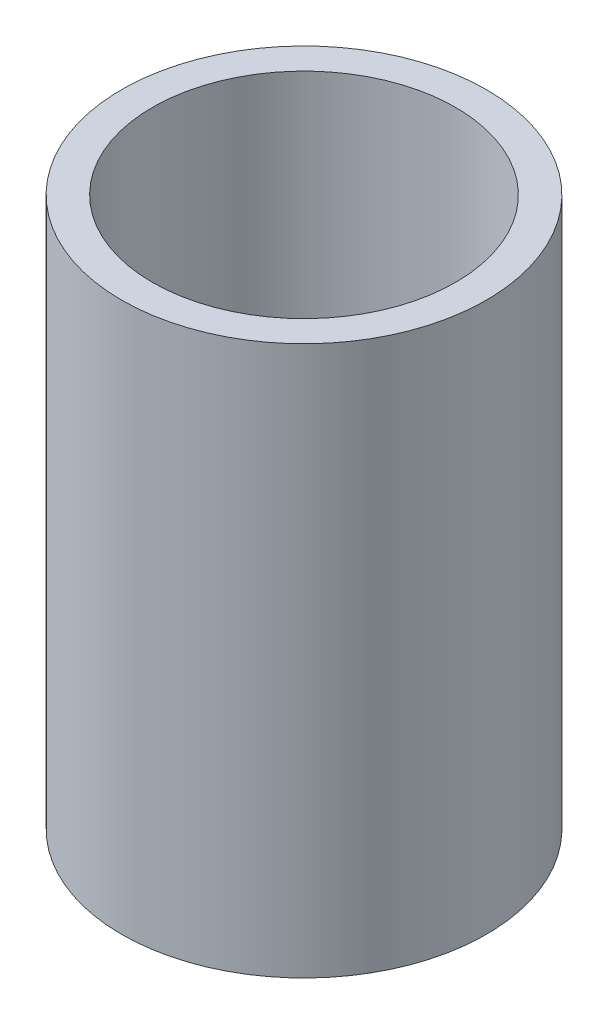
ISO-10303-21;
HEADER;
FILE_DESCRIPTION(('STEP AP214'),'2;1');
FILE_NAME('part.step','',(''),(''),'','','');
FILE_SCHEMA(('AUTOMOTIVE_DESIGN { 1 0 10303 214 1 1 1 1 }'));
ENDSEC;
DATA;
#1=APPLICATION_CONTEXT('core data for automotive mechanical design processes');
#2=APPLICATION_PROTOCOL_DEFINITION('international standard','automotive_design',2000,#1);
#3=PRODUCT_CONTEXT('',#1,'mechanical');
#4=PRODUCT('Part','Part','',(#3));
#5=PRODUCT_RELATED_PRODUCT_CATEGORY('part','',(#4));
#6=PRODUCT_DEFINITION_FORMATION('','',#4);
#7=PRODUCT_DEFINITION_CONTEXT('part definition',#1,'design');
#8=PRODUCT_DEFINITION('design','',#6,#7);
#9=PRODUCT_DEFINITION_SHAPE('','',#8);
#10=(LENGTH_UNIT() NAMED_UNIT(*) SI_UNIT(.MILLI.,.METRE.));
#11=(NAMED_UNIT(*) PLANE_ANGLE_UNIT() SI_UNIT($,.RADIAN.));
#12=(NAMED_UNIT(*) SI_UNIT($,.STERADIAN.) SOLID_ANGLE_UNIT());
#13=UNCERTAINTY_MEASURE_WITH_UNIT(LENGTH_MEASURE(1.E-05),#10,'distance_accuracy_value','');
#14=(GEOMETRIC_REPRESENTATION_CONTEXT(3) GLOBAL_UNCERTAINTY_ASSIGNED_CONTEXT((#13)) GLOBAL_UNIT_ASSIGNED_CONTEXT((#10,
#11,#12)) REPRESENTATION_CONTEXT('',''));
#15=CARTESIAN_POINT('',(0.,0.,0.));
#16=DIRECTION('',(0.,0.,1.));
#17=DIRECTION('',(1.,0.,0.));
#18=AXIS2_PLACEMENT_3D('',#15,#16,#17);
#19=CARTESIAN_POINT('',(0.,63.4999999999999,0.));
#20=DIRECTION('',(0.,1.,0.));
#21=DIRECTION('',(0.,0.,1.));
#22=AXIS2_PLACEMENT_3D('',#19,#20,#21);
#23=PLANE('',#22);
#24=CARTESIAN_POINT('',(0.,63.4999999999999,0.));
#25=DIRECTION('',(0.,1.,0.));
#26=DIRECTION('',(0.,0.,1.));
#27=AXIS2_PLACEMENT_3D('',#24,#25,#26);
#28=CIRCLE('',#27,21.082);
#29=CARTESIAN_POINT('',(0.,63.4999999999999,21.082));
#30=VERTEX_POINT('',#29);
#31=EDGE_CURVE('E10',#30,#30,#28,.T.);
#32=ORIENTED_EDGE('',*,*,#31,.T.);
#33=EDGE_LOOP('',(#32));
#34=FACE_BOUND('',#33,.T.);
#35=CARTESIAN_POINT('',(0.,63.4999999999999,0.));
#36=DIRECTION('',(0.,1.,0.));
#37=DIRECTION('',(0.,0.,1.));
#38=AXIS2_PLACEMENT_3D('',#35,#36,#37);
#39=CIRCLE('',#38,17.526);
#40=CARTESIAN_POINT('',(0.,63.4999999999999,17.526));
#41=VERTEX_POINT('',#40);
#42=EDGE_CURVE('E39',#41,#41,#39,.T.);
#43=ORIENTED_EDGE('',*,*,#42,.F.);
#44=EDGE_LOOP('',(#43));
#45=FACE_BOUND('',#44,.T.);
#46=ADVANCED_FACE('F28',(#34,#45),#23,.T.);
#47=CARTESIAN_POINT('',(0.,0.,0.));
#48=DIRECTION('',(0.,1.,0.));
#49=DIRECTION('',(0.,0.,1.));
#50=AXIS2_PLACEMENT_3D('',#47,#48,#49);
#51=PLANE('',#50);
#52=CARTESIAN_POINT('',(0.,0.,0.));
#53=DIRECTION('',(0.,1.,0.));
#54=DIRECTION('',(0.,0.,1.));
#55=AXIS2_PLACEMENT_3D('',#52,#53,#54);
#56=CIRCLE('',#55,21.082);
#57=CARTESIAN_POINT('',(0.,0.,21.082));
#58=VERTEX_POINT('',#57);
#59=EDGE_CURVE('E32',#58,#58,#56,.T.);
#60=ORIENTED_EDGE('',*,*,#59,.F.);
#61=EDGE_LOOP('',(#60));
#62=FACE_BOUND('',#61,.T.);
#63=CARTESIAN_POINT('',(0.,0.,0.));
#64=DIRECTION('',(0.,1.,0.));
#65=DIRECTION('',(0.,0.,1.));
#66=AXIS2_PLACEMENT_3D('',#63,#64,#65);
#67=CIRCLE('',#66,17.526);
#68=CARTESIAN_POINT('',(0.,0.,17.526));
#69=VERTEX_POINT('',#68);
#70=EDGE_CURVE('E41',#69,#69,#67,.T.);
#71=ORIENTED_EDGE('',*,*,#70,.T.);
#72=EDGE_LOOP('',(#71));
#73=FACE_BOUND('',#72,.T.);
#74=ADVANCED_FACE('F51',(#62,#73),#51,.F.);
#75=CARTESIAN_POINT('',(0.,63.4999999999999,0.));
#76=DIRECTION('',(0.,-1.,0.));
#77=DIRECTION('',(0.,0.,-1.));
#78=AXIS2_PLACEMENT_3D('',#75,#76,#77);
#79=CYLINDRICAL_SURFACE('',#78,21.082);
#80=ORIENTED_EDGE('',*,*,#31,.F.);
#81=EDGE_LOOP('',(#80));
#82=FACE_BOUND('',#81,.T.);
#83=ORIENTED_EDGE('',*,*,#59,.T.);
#84=EDGE_LOOP('',(#83));
#85=FACE_BOUND('',#84,.T.);
#86=ADVANCED_FACE('F30',(#82,#85),#79,.T.);
#87=CARTESIAN_POINT('',(0.,63.4999999999999,0.));
#88=DIRECTION('',(0.,-1.,0.));
#89=DIRECTION('',(0.,0.,-1.));
#90=AXIS2_PLACEMENT_3D('',#87,#88,#89);
#91=CYLINDRICAL_SURFACE('',#90,17.526);
#92=ORIENTED_EDGE('',*,*,#42,.T.);
#93=EDGE_LOOP('',(#92));
#94=FACE_BOUND('',#93,.T.);
#95=ORIENTED_EDGE('',*,*,#70,.F.);
#96=EDGE_LOOP('',(#95));
#97=FACE_BOUND('',#96,.T.);
#98=ADVANCED_FACE('F47',(#94,#97),#91,.F.);
#99=CLOSED_SHELL('',(#46,#74,#86,#98));
#100=MANIFOLD_SOLID_BREP('B2',#99);
#101=ADVANCED_BREP_SHAPE_REPRESENTATION('',(#18,#100),#14);
#102=SHAPE_DEFINITION_REPRESENTATION(#9,#101);
ENDSEC;
END-ISO-10303-21;
